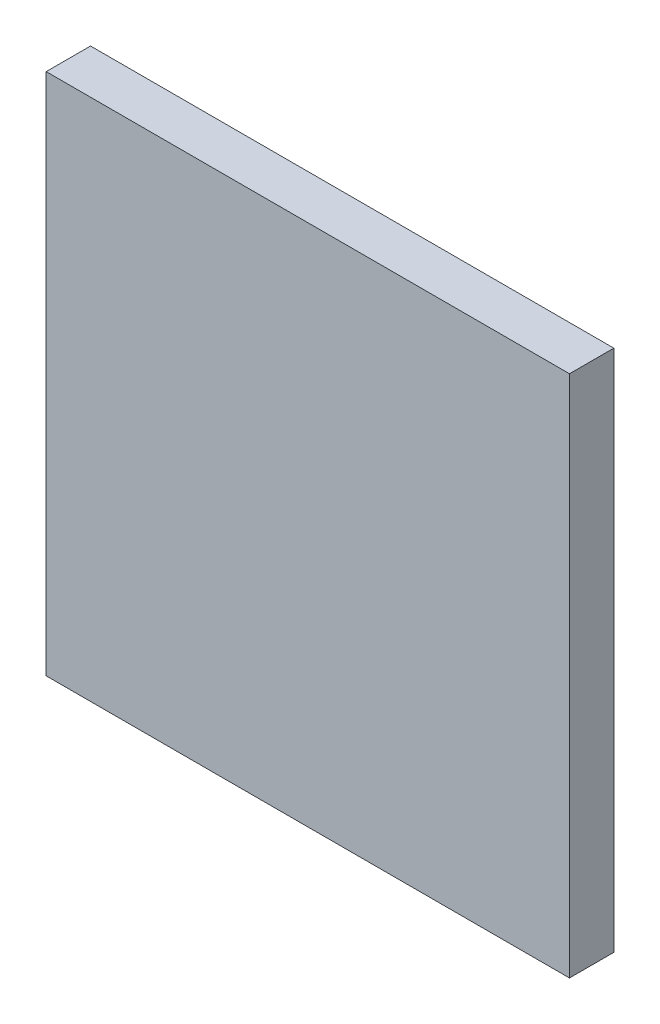
ISO-10303-21;
HEADER;
FILE_DESCRIPTION(('STEP AP214'),'2;1');
FILE_NAME('part.step','',(''),(''),'','','');
FILE_SCHEMA(('AUTOMOTIVE_DESIGN { 1 0 10303 214 1 1 1 1 }'));
ENDSEC;
DATA;
#1=APPLICATION_CONTEXT('core data for automotive mechanical design processes');
#2=APPLICATION_PROTOCOL_DEFINITION('international standard','automotive_design',2000,#1);
#3=PRODUCT_CONTEXT('',#1,'mechanical');
#4=PRODUCT('Part','Part','',(#3));
#5=PRODUCT_RELATED_PRODUCT_CATEGORY('part','',(#4));
#6=PRODUCT_DEFINITION_FORMATION('','',#4);
#7=PRODUCT_DEFINITION_CONTEXT('part definition',#1,'design');
#8=PRODUCT_DEFINITION('design','',#6,#7);
#9=PRODUCT_DEFINITION_SHAPE('','',#8);
#10=(LENGTH_UNIT() NAMED_UNIT(*) SI_UNIT(.MILLI.,.METRE.));
#11=(NAMED_UNIT(*) PLANE_ANGLE_UNIT() SI_UNIT($,.RADIAN.));
#12=(NAMED_UNIT(*) SI_UNIT($,.STERADIAN.) SOLID_ANGLE_UNIT());
#13=UNCERTAINTY_MEASURE_WITH_UNIT(LENGTH_MEASURE(1.E-05),#10,'distance_accuracy_value','');
#14=(GEOMETRIC_REPRESENTATION_CONTEXT(3) GLOBAL_UNCERTAINTY_ASSIGNED_CONTEXT((#13)) GLOBAL_UNIT_ASSIGNED_CONTEXT((#10,
#11,#12)) REPRESENTATION_CONTEXT('',''));
#15=CARTESIAN_POINT('',(0.,0.,0.));
#16=DIRECTION('',(0.,0.,1.));
#17=DIRECTION('',(1.,0.,0.));
#18=AXIS2_PLACEMENT_3D('',#15,#16,#17);
#19=CARTESIAN_POINT('',(980.,59.,51.5));
#20=DIRECTION('',(1.,0.,0.));
#21=DIRECTION('',(0.,0.,-1.));
#22=AXIS2_PLACEMENT_3D('',#19,#20,#21);
#23=PLANE('',#22);
#24=DIRECTION('',(0.,1.,0.));
#25=VECTOR('',#24,1.);
#26=CARTESIAN_POINT('',(980.,59.,61.5));
#27=LINE('',#26,#25);
#28=CARTESIAN_POINT('',(980.,-59.,61.5));
#29=VERTEX_POINT('',#28);
#30=CARTESIAN_POINT('',(980.,59.,61.5));
#31=VERTEX_POINT('',#30);
#32=EDGE_CURVE('E111',#29,#31,#27,.T.);
#33=ORIENTED_EDGE('',*,*,#32,.F.);
#34=DIRECTION('',(0.,0.,1.));
#35=VECTOR('',#34,1.);
#36=CARTESIAN_POINT('',(980.,-59.,51.5));
#37=LINE('',#36,#35);
#38=CARTESIAN_POINT('',(980.,-59.,51.5));
#39=VERTEX_POINT('',#38);
#40=EDGE_CURVE('E11',#39,#29,#37,.T.);
#41=ORIENTED_EDGE('',*,*,#40,.F.);
#42=DIRECTION('',(0.,1.,0.));
#43=VECTOR('',#42,1.);
#44=CARTESIAN_POINT('',(980.,59.,51.5));
#45=LINE('',#44,#43);
#46=CARTESIAN_POINT('',(980.,59.,51.5));
#47=VERTEX_POINT('',#46);
#48=EDGE_CURVE('E102',#39,#47,#45,.T.);
#49=ORIENTED_EDGE('',*,*,#48,.T.);
#50=DIRECTION('',(0.,0.,1.));
#51=VECTOR('',#50,1.);
#52=CARTESIAN_POINT('',(980.,59.,51.5));
#53=LINE('',#52,#51);
#54=EDGE_CURVE('E43',#47,#31,#53,.T.);
#55=ORIENTED_EDGE('',*,*,#54,.T.);
#56=EDGE_LOOP('',(#33,#41,#49,#55));
#57=FACE_BOUND('',#56,.T.);
#58=ADVANCED_FACE('F40',(#57),#23,.T.);
#59=CARTESIAN_POINT('',(980.,-59.,51.5));
#60=DIRECTION('',(0.,-1.,0.));
#61=DIRECTION('',(1.,0.,0.));
#62=AXIS2_PLACEMENT_3D('',#59,#60,#61);
#63=PLANE('',#62);
#64=DIRECTION('',(1.,0.,0.));
#65=VECTOR('',#64,1.);
#66=CARTESIAN_POINT('',(980.,-59.,61.5));
#67=LINE('',#66,#65);
#68=CARTESIAN_POINT('',(862.,-59.,61.5));
#69=VERTEX_POINT('',#68);
#70=EDGE_CURVE('E106',#69,#29,#67,.T.);
#71=ORIENTED_EDGE('',*,*,#70,.F.);
#72=DIRECTION('',(0.,0.,1.));
#73=VECTOR('',#72,1.);
#74=CARTESIAN_POINT('',(862.,-59.,51.5));
#75=LINE('',#74,#73);
#76=CARTESIAN_POINT('',(862.,-59.,51.5));
#77=VERTEX_POINT('',#76);
#78=EDGE_CURVE('E50',#77,#69,#75,.T.);
#79=ORIENTED_EDGE('',*,*,#78,.F.);
#80=DIRECTION('',(1.,0.,0.));
#81=VECTOR('',#80,1.);
#82=CARTESIAN_POINT('',(980.,-59.,51.5));
#83=LINE('',#82,#81);
#84=EDGE_CURVE('E97',#77,#39,#83,.T.);
#85=ORIENTED_EDGE('',*,*,#84,.T.);
#86=ORIENTED_EDGE('',*,*,#40,.T.);
#87=EDGE_LOOP('',(#71,#79,#85,#86));
#88=FACE_BOUND('',#87,.T.);
#89=ADVANCED_FACE('F130',(#88),#63,.T.);
#90=CARTESIAN_POINT('',(862.,59.,51.5));
#91=DIRECTION('',(-1.,0.,0.));
#92=DIRECTION('',(0.,0.,1.));
#93=AXIS2_PLACEMENT_3D('',#90,#91,#92);
#94=PLANE('',#93);
#95=DIRECTION('',(0.,-1.,0.));
#96=VECTOR('',#95,1.);
#97=CARTESIAN_POINT('',(862.,59.,61.5));
#98=LINE('',#97,#96);
#99=CARTESIAN_POINT('',(862.,59.,61.5));
#100=VERTEX_POINT('',#99);
#101=EDGE_CURVE('E91',#100,#69,#98,.T.);
#102=ORIENTED_EDGE('',*,*,#101,.F.);
#103=DIRECTION('',(0.,0.,1.));
#104=VECTOR('',#103,1.);
#105=CARTESIAN_POINT('',(862.,59.,51.5));
#106=LINE('',#105,#104);
#107=CARTESIAN_POINT('',(862.,59.,51.5));
#108=VERTEX_POINT('',#107);
#109=EDGE_CURVE('E86',#108,#100,#106,.T.);
#110=ORIENTED_EDGE('',*,*,#109,.F.);
#111=DIRECTION('',(0.,-1.,0.));
#112=VECTOR('',#111,1.);
#113=CARTESIAN_POINT('',(862.,59.,51.5));
#114=LINE('',#113,#112);
#115=EDGE_CURVE('E89',#108,#77,#114,.T.);
#116=ORIENTED_EDGE('',*,*,#115,.T.);
#117=ORIENTED_EDGE('',*,*,#78,.T.);
#118=EDGE_LOOP('',(#102,#110,#116,#117));
#119=FACE_BOUND('',#118,.T.);
#120=ADVANCED_FACE('F88',(#119),#94,.T.);
#121=CARTESIAN_POINT('',(980.,59.,51.5));
#122=DIRECTION('',(0.,1.,0.));
#123=DIRECTION('',(-1.,0.,0.));
#124=AXIS2_PLACEMENT_3D('',#121,#122,#123);
#125=PLANE('',#124);
#126=DIRECTION('',(-1.,0.,0.));
#127=VECTOR('',#126,1.);
#128=CARTESIAN_POINT('',(980.,59.,61.5));
#129=LINE('',#128,#127);
#130=EDGE_CURVE('E115',#31,#100,#129,.T.);
#131=ORIENTED_EDGE('',*,*,#130,.F.);
#132=ORIENTED_EDGE('',*,*,#54,.F.);
#133=DIRECTION('',(-1.,0.,0.));
#134=VECTOR('',#133,1.);
#135=CARTESIAN_POINT('',(980.,59.,51.5));
#136=LINE('',#135,#134);
#137=EDGE_CURVE('E96',#47,#108,#136,.T.);
#138=ORIENTED_EDGE('',*,*,#137,.T.);
#139=ORIENTED_EDGE('',*,*,#109,.T.);
#140=EDGE_LOOP('',(#131,#132,#138,#139));
#141=FACE_BOUND('',#140,.T.);
#142=ADVANCED_FACE('F100',(#141),#125,.T.);
#143=CARTESIAN_POINT('',(0.,0.,51.5));
#144=DIRECTION('',(0.,0.,-1.));
#145=DIRECTION('',(-1.,0.,0.));
#146=AXIS2_PLACEMENT_3D('',#143,#144,#145);
#147=PLANE('',#146);
#148=ORIENTED_EDGE('',*,*,#48,.F.);
#149=ORIENTED_EDGE('',*,*,#84,.F.);
#150=ORIENTED_EDGE('',*,*,#115,.F.);
#151=ORIENTED_EDGE('',*,*,#137,.F.);
#152=EDGE_LOOP('',(#148,#149,#150,#151));
#153=FACE_BOUND('',#152,.T.);
#154=ADVANCED_FACE('F95',(#153),#147,.T.);
#155=CARTESIAN_POINT('',(0.,0.,61.5));
#156=DIRECTION('',(0.,0.,-1.));
#157=DIRECTION('',(-1.,0.,0.));
#158=AXIS2_PLACEMENT_3D('',#155,#156,#157);
#159=PLANE('',#158);
#160=ORIENTED_EDGE('',*,*,#32,.T.);
#161=ORIENTED_EDGE('',*,*,#130,.T.);
#162=ORIENTED_EDGE('',*,*,#101,.T.);
#163=ORIENTED_EDGE('',*,*,#70,.T.);
#164=EDGE_LOOP('',(#160,#161,#162,#163));
#165=FACE_BOUND('',#164,.T.);
#166=ADVANCED_FACE('F129',(#165),#159,.F.);
#167=CLOSED_SHELL('',(#58,#89,#120,#142,#154,#166));
#168=MANIFOLD_SOLID_BREP('B2',#167);
#169=ADVANCED_BREP_SHAPE_REPRESENTATION('',(#18,#168),#14);
#170=SHAPE_DEFINITION_REPRESENTATION(#9,#169);
ENDSEC;
END-ISO-10303-21;
